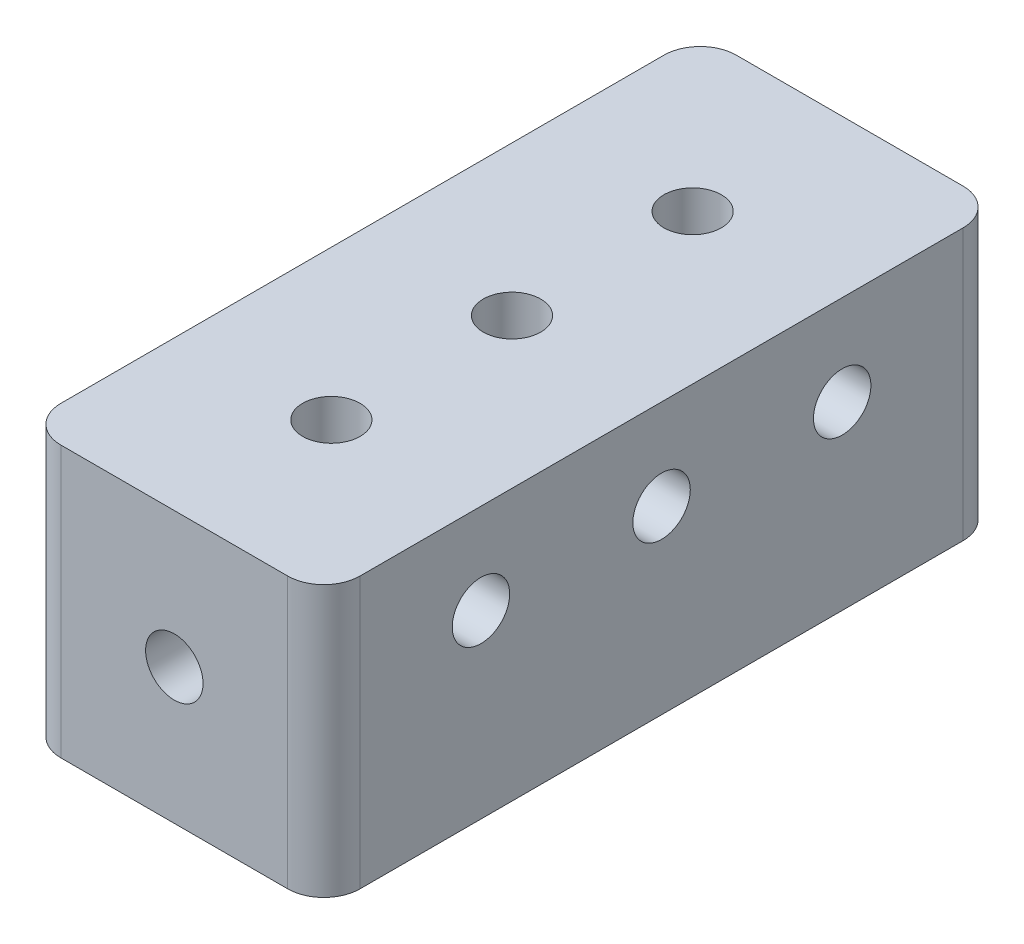
ISO-10303-21;
HEADER;
FILE_DESCRIPTION(('STEP AP214'),'2;1');
FILE_NAME('part.step','',(''),(''),'','','');
FILE_SCHEMA(('AUTOMOTIVE_DESIGN { 1 0 10303 214 1 1 1 1 }'));
ENDSEC;
DATA;
#1=APPLICATION_CONTEXT('core data for automotive mechanical design processes');
#2=APPLICATION_PROTOCOL_DEFINITION('international standard','automotive_design',2000,#1);
#3=PRODUCT_CONTEXT('',#1,'mechanical');
#4=PRODUCT('Part','Part','',(#3));
#5=PRODUCT_RELATED_PRODUCT_CATEGORY('part','',(#4));
#6=PRODUCT_DEFINITION_FORMATION('','',#4);
#7=PRODUCT_DEFINITION_CONTEXT('part definition',#1,'design');
#8=PRODUCT_DEFINITION('design','',#6,#7);
#9=PRODUCT_DEFINITION_SHAPE('','',#8);
#10=(LENGTH_UNIT() NAMED_UNIT(*) SI_UNIT(.MILLI.,.METRE.));
#11=(NAMED_UNIT(*) PLANE_ANGLE_UNIT() SI_UNIT($,.RADIAN.));
#12=(NAMED_UNIT(*) SI_UNIT($,.STERADIAN.) SOLID_ANGLE_UNIT());
#13=UNCERTAINTY_MEASURE_WITH_UNIT(LENGTH_MEASURE(1.E-05),#10,'distance_accuracy_value','');
#14=(GEOMETRIC_REPRESENTATION_CONTEXT(3) GLOBAL_UNCERTAINTY_ASSIGNED_CONTEXT((#13)) GLOBAL_UNIT_ASSIGNED_CONTEXT((#10,
#11,#12)) REPRESENTATION_CONTEXT('',''));
#15=CARTESIAN_POINT('',(0.,0.,0.));
#16=DIRECTION('',(0.,0.,1.));
#17=DIRECTION('',(1.,0.,0.));
#18=AXIS2_PLACEMENT_3D('',#15,#16,#17);
#19=CARTESIAN_POINT('',(10.5156,9.525,23.74265));
#20=DIRECTION('',(-1.,0.,0.));
#21=DIRECTION('',(0.,0.,1.));
#22=AXIS2_PLACEMENT_3D('',#19,#20,#21);
#23=PLANE('',#22);
#24=CARTESIAN_POINT('',(10.5156,3.175,12.7));
#25=DIRECTION('',(1.,0.,0.));
#26=DIRECTION('',(0.,0.,-1.));
#27=AXIS2_PLACEMENT_3D('',#24,#25,#26);
#28=CIRCLE('',#27,2.0193);
#29=CARTESIAN_POINT('',(10.5156,3.175,10.6807));
#30=VERTEX_POINT('',#29);
#31=EDGE_CURVE('E205',#30,#30,#28,.T.);
#32=ORIENTED_EDGE('',*,*,#31,.F.);
#33=EDGE_LOOP('',(#32));
#34=FACE_BOUND('',#33,.T.);
#35=CARTESIAN_POINT('',(10.5156,3.175,-12.7));
#36=DIRECTION('',(1.,0.,0.));
#37=DIRECTION('',(0.,0.,-1.));
#38=AXIS2_PLACEMENT_3D('',#35,#36,#37);
#39=CIRCLE('',#38,2.0193);
#40=CARTESIAN_POINT('',(10.5156,3.175,-14.7193));
#41=VERTEX_POINT('',#40);
#42=EDGE_CURVE('E199',#41,#41,#39,.T.);
#43=ORIENTED_EDGE('',*,*,#42,.F.);
#44=EDGE_LOOP('',(#43));
#45=FACE_BOUND('',#44,.T.);
#46=CARTESIAN_POINT('',(10.5156,3.175,0.));
#47=DIRECTION('',(1.,0.,0.));
#48=DIRECTION('',(0.,0.,-1.));
#49=AXIS2_PLACEMENT_3D('',#46,#47,#48);
#50=CIRCLE('',#49,2.0193);
#51=CARTESIAN_POINT('',(10.5156,3.175,-2.0193));
#52=VERTEX_POINT('',#51);
#53=EDGE_CURVE('E192',#52,#52,#50,.T.);
#54=ORIENTED_EDGE('',*,*,#53,.F.);
#55=EDGE_LOOP('',(#54));
#56=FACE_BOUND('',#55,.T.);
#57=DIRECTION('',(0.,0.,-1.));
#58=VECTOR('',#57,1.);
#59=CARTESIAN_POINT('',(10.5156,9.525,23.74265));
#60=LINE('',#59,#58);
#61=CARTESIAN_POINT('',(10.5156,9.525,21.20265));
#62=VERTEX_POINT('',#61);
#63=CARTESIAN_POINT('',(10.5156,9.525,-21.20265));
#64=VERTEX_POINT('',#63);
#65=EDGE_CURVE('E123',#62,#64,#60,.T.);
#66=ORIENTED_EDGE('',*,*,#65,.F.);
#67=DIRECTION('',(0.,-1.,0.));
#68=VECTOR('',#67,1.);
#69=CARTESIAN_POINT('',(10.5156,9.525,21.20265));
#70=LINE('',#69,#68);
#71=CARTESIAN_POINT('',(10.5156,-9.525,21.20265));
#72=VERTEX_POINT('',#71);
#73=EDGE_CURVE('E108',#62,#72,#70,.T.);
#74=ORIENTED_EDGE('',*,*,#73,.T.);
#75=DIRECTION('',(0.,0.,-1.));
#76=VECTOR('',#75,1.);
#77=CARTESIAN_POINT('',(10.5156,-9.525,23.74265));
#78=LINE('',#77,#76);
#79=CARTESIAN_POINT('',(10.5156,-9.525,-21.20265));
#80=VERTEX_POINT('',#79);
#81=EDGE_CURVE('E120',#72,#80,#78,.T.);
#82=ORIENTED_EDGE('',*,*,#81,.T.);
#83=DIRECTION('',(0.,-1.,0.));
#84=VECTOR('',#83,1.);
#85=CARTESIAN_POINT('',(10.5156,9.525,-21.20265));
#86=LINE('',#85,#84);
#87=EDGE_CURVE('E125',#80,#64,#86,.F.);
#88=ORIENTED_EDGE('',*,*,#87,.T.);
#89=EDGE_LOOP('',(#66,#74,#82,#88));
#90=FACE_BOUND('',#89,.T.);
#91=ADVANCED_FACE('F38',(#34,#45,#56,#90),#23,.F.);
#92=CARTESIAN_POINT('',(-10.5156,9.525,-23.74265));
#93=DIRECTION('',(0.,0.,1.));
#94=DIRECTION('',(1.,0.,0.));
#95=AXIS2_PLACEMENT_3D('',#92,#93,#94);
#96=PLANE('',#95);
#97=CARTESIAN_POINT('',(0.,0.,-23.74265));
#98=DIRECTION('',(0.,0.,-1.));
#99=DIRECTION('',(-1.,0.,0.));
#100=AXIS2_PLACEMENT_3D('',#97,#98,#99);
#101=CIRCLE('',#100,2.0193);
#102=CARTESIAN_POINT('',(-2.0193,0.,-23.74265));
#103=VERTEX_POINT('',#102);
#104=EDGE_CURVE('E186',#103,#103,#101,.T.);
#105=ORIENTED_EDGE('',*,*,#104,.F.);
#106=EDGE_LOOP('',(#105));
#107=FACE_BOUND('',#106,.T.);
#108=DIRECTION('',(-1.,0.,0.));
#109=VECTOR('',#108,1.);
#110=CARTESIAN_POINT('',(-10.5156,-9.525,-23.74265));
#111=LINE('',#110,#109);
#112=CARTESIAN_POINT('',(7.9756,-9.525,-23.74265));
#113=VERTEX_POINT('',#112);
#114=CARTESIAN_POINT('',(-7.9756,-9.525,-23.74265));
#115=VERTEX_POINT('',#114);
#116=EDGE_CURVE('E129',#113,#115,#111,.T.);
#117=ORIENTED_EDGE('',*,*,#116,.T.);
#118=DIRECTION('',(0.,-1.,0.));
#119=VECTOR('',#118,1.);
#120=CARTESIAN_POINT('',(-7.9756,9.525,-23.74265));
#121=LINE('',#120,#119);
#122=CARTESIAN_POINT('',(-7.9756,9.525,-23.74265));
#123=VERTEX_POINT('',#122);
#124=EDGE_CURVE('E11',#115,#123,#121,.F.);
#125=ORIENTED_EDGE('',*,*,#124,.T.);
#126=DIRECTION('',(-1.,0.,0.));
#127=VECTOR('',#126,1.);
#128=CARTESIAN_POINT('',(-10.5156,9.525,-23.74265));
#129=LINE('',#128,#127);
#130=CARTESIAN_POINT('',(7.9756,9.525,-23.74265));
#131=VERTEX_POINT('',#130);
#132=EDGE_CURVE('E169',#131,#123,#129,.T.);
#133=ORIENTED_EDGE('',*,*,#132,.F.);
#134=DIRECTION('',(0.,-1.,0.));
#135=VECTOR('',#134,1.);
#136=CARTESIAN_POINT('',(7.9756,9.525,-23.74265));
#137=LINE('',#136,#135);
#138=EDGE_CURVE('E46',#131,#113,#137,.T.);
#139=ORIENTED_EDGE('',*,*,#138,.T.);
#140=EDGE_LOOP('',(#117,#125,#133,#139));
#141=FACE_BOUND('',#140,.T.);
#142=ADVANCED_FACE('F167',(#107,#141),#96,.F.);
#143=CARTESIAN_POINT('',(-10.5156,9.525,23.74265));
#144=DIRECTION('',(1.,0.,0.));
#145=DIRECTION('',(0.,0.,-1.));
#146=AXIS2_PLACEMENT_3D('',#143,#144,#145);
#147=PLANE('',#146);
#148=CARTESIAN_POINT('',(-10.5156,3.175,-12.7));
#149=DIRECTION('',(-1.,0.,0.));
#150=DIRECTION('',(0.,0.,1.));
#151=AXIS2_PLACEMENT_3D('',#148,#149,#150);
#152=CIRCLE('',#151,2.0193);
#153=CARTESIAN_POINT('',(-10.5156,3.175,-10.6807));
#154=VERTEX_POINT('',#153);
#155=EDGE_CURVE('E223',#154,#154,#152,.T.);
#156=ORIENTED_EDGE('',*,*,#155,.F.);
#157=EDGE_LOOP('',(#156));
#158=FACE_BOUND('',#157,.T.);
#159=CARTESIAN_POINT('',(-10.5156,3.175,0.));
#160=DIRECTION('',(-1.,0.,0.));
#161=DIRECTION('',(0.,0.,1.));
#162=AXIS2_PLACEMENT_3D('',#159,#160,#161);
#163=CIRCLE('',#162,2.0193);
#164=CARTESIAN_POINT('',(-10.5156,3.175,2.0193));
#165=VERTEX_POINT('',#164);
#166=EDGE_CURVE('E217',#165,#165,#163,.T.);
#167=ORIENTED_EDGE('',*,*,#166,.F.);
#168=EDGE_LOOP('',(#167));
#169=FACE_BOUND('',#168,.T.);
#170=CARTESIAN_POINT('',(-10.5156,3.175,12.7));
#171=DIRECTION('',(-1.,0.,0.));
#172=DIRECTION('',(0.,0.,1.));
#173=AXIS2_PLACEMENT_3D('',#170,#171,#172);
#174=CIRCLE('',#173,2.0193);
#175=CARTESIAN_POINT('',(-10.5156,3.175,14.7193));
#176=VERTEX_POINT('',#175);
#177=EDGE_CURVE('E210',#176,#176,#174,.T.);
#178=ORIENTED_EDGE('',*,*,#177,.F.);
#179=EDGE_LOOP('',(#178));
#180=FACE_BOUND('',#179,.T.);
#181=DIRECTION('',(0.,0.,1.));
#182=VECTOR('',#181,1.);
#183=CARTESIAN_POINT('',(-10.5156,-9.525,23.74265));
#184=LINE('',#183,#182);
#185=CARTESIAN_POINT('',(-10.5156,-9.525,-21.20265));
#186=VERTEX_POINT('',#185);
#187=CARTESIAN_POINT('',(-10.5156,-9.525,21.20265));
#188=VERTEX_POINT('',#187);
#189=EDGE_CURVE('E133',#186,#188,#184,.T.);
#190=ORIENTED_EDGE('',*,*,#189,.T.);
#191=DIRECTION('',(0.,-1.,0.));
#192=VECTOR('',#191,1.);
#193=CARTESIAN_POINT('',(-10.5156,9.525,21.20265));
#194=LINE('',#193,#192);
#195=CARTESIAN_POINT('',(-10.5156,9.525,21.20265));
#196=VERTEX_POINT('',#195);
#197=EDGE_CURVE('E53',#188,#196,#194,.F.);
#198=ORIENTED_EDGE('',*,*,#197,.T.);
#199=DIRECTION('',(0.,0.,1.));
#200=VECTOR('',#199,1.);
#201=CARTESIAN_POINT('',(-10.5156,9.525,23.74265));
#202=LINE('',#201,#200);
#203=CARTESIAN_POINT('',(-10.5156,9.525,-21.20265));
#204=VERTEX_POINT('',#203);
#205=EDGE_CURVE('E177',#204,#196,#202,.T.);
#206=ORIENTED_EDGE('',*,*,#205,.F.);
#207=DIRECTION('',(0.,-1.,0.));
#208=VECTOR('',#207,1.);
#209=CARTESIAN_POINT('',(-10.5156,9.525,-21.20265));
#210=LINE('',#209,#208);
#211=EDGE_CURVE('E160',#204,#186,#210,.T.);
#212=ORIENTED_EDGE('',*,*,#211,.T.);
#213=EDGE_LOOP('',(#190,#198,#206,#212));
#214=FACE_BOUND('',#213,.T.);
#215=ADVANCED_FACE('F176',(#158,#169,#180,#214),#147,.F.);
#216=CARTESIAN_POINT('',(-10.5156,9.525,23.74265));
#217=DIRECTION('',(0.,0.,-1.));
#218=DIRECTION('',(-1.,0.,0.));
#219=AXIS2_PLACEMENT_3D('',#216,#217,#218);
#220=PLANE('',#219);
#221=CARTESIAN_POINT('',(0.,0.,23.74265));
#222=DIRECTION('',(0.,0.,1.));
#223=DIRECTION('',(1.,0.,0.));
#224=AXIS2_PLACEMENT_3D('',#221,#222,#223);
#225=CIRCLE('',#224,2.0193);
#226=CARTESIAN_POINT('',(2.0193,0.,23.74265));
#227=VERTEX_POINT('',#226);
#228=EDGE_CURVE('E136',#227,#227,#225,.T.);
#229=ORIENTED_EDGE('',*,*,#228,.F.);
#230=EDGE_LOOP('',(#229));
#231=FACE_BOUND('',#230,.T.);
#232=DIRECTION('',(1.,0.,0.));
#233=VECTOR('',#232,1.);
#234=CARTESIAN_POINT('',(-10.5156,-9.525,23.74265));
#235=LINE('',#234,#233);
#236=CARTESIAN_POINT('',(-7.9756,-9.525,23.74265));
#237=VERTEX_POINT('',#236);
#238=CARTESIAN_POINT('',(7.9756,-9.525,23.74265));
#239=VERTEX_POINT('',#238);
#240=EDGE_CURVE('E143',#237,#239,#235,.T.);
#241=ORIENTED_EDGE('',*,*,#240,.T.);
#242=DIRECTION('',(0.,-1.,0.));
#243=VECTOR('',#242,1.);
#244=CARTESIAN_POINT('',(7.9756,9.525,23.74265));
#245=LINE('',#244,#243);
#246=CARTESIAN_POINT('',(7.9756,9.525,23.74265));
#247=VERTEX_POINT('',#246);
#248=EDGE_CURVE('E109',#239,#247,#245,.F.);
#249=ORIENTED_EDGE('',*,*,#248,.T.);
#250=DIRECTION('',(1.,0.,0.));
#251=VECTOR('',#250,1.);
#252=CARTESIAN_POINT('',(-10.5156,9.525,23.74265));
#253=LINE('',#252,#251);
#254=CARTESIAN_POINT('',(-7.9756,9.525,23.74265));
#255=VERTEX_POINT('',#254);
#256=EDGE_CURVE('E139',#255,#247,#253,.T.);
#257=ORIENTED_EDGE('',*,*,#256,.F.);
#258=DIRECTION('',(0.,-1.,0.));
#259=VECTOR('',#258,1.);
#260=CARTESIAN_POINT('',(-7.9756,9.525,23.74265));
#261=LINE('',#260,#259);
#262=EDGE_CURVE('E114',#255,#237,#261,.T.);
#263=ORIENTED_EDGE('',*,*,#262,.T.);
#264=EDGE_LOOP('',(#241,#249,#257,#263));
#265=FACE_BOUND('',#264,.T.);
#266=ADVANCED_FACE('F258',(#231,#265),#220,.F.);
#267=CARTESIAN_POINT('',(0.,9.525,0.));
#268=DIRECTION('',(0.,-1.,0.));
#269=DIRECTION('',(0.,0.,-1.));
#270=AXIS2_PLACEMENT_3D('',#267,#268,#269);
#271=PLANE('',#270);
#272=CARTESIAN_POINT('',(0.,9.525,-12.7));
#273=DIRECTION('',(0.,1.,0.));
#274=DIRECTION('',(0.,0.,1.));
#275=AXIS2_PLACEMENT_3D('',#272,#273,#274);
#276=CIRCLE('',#275,2.0193);
#277=CARTESIAN_POINT('',(0.,9.525,-10.6807));
#278=VERTEX_POINT('',#277);
#279=EDGE_CURVE('E240',#278,#278,#276,.T.);
#280=ORIENTED_EDGE('',*,*,#279,.F.);
#281=EDGE_LOOP('',(#280));
#282=FACE_BOUND('',#281,.T.);
#283=CARTESIAN_POINT('',(0.,9.525,0.));
#284=DIRECTION('',(0.,1.,0.));
#285=DIRECTION('',(0.,0.,1.));
#286=AXIS2_PLACEMENT_3D('',#283,#284,#285);
#287=CIRCLE('',#286,2.0193);
#288=CARTESIAN_POINT('',(0.,9.525,2.0193));
#289=VERTEX_POINT('',#288);
#290=EDGE_CURVE('E234',#289,#289,#287,.T.);
#291=ORIENTED_EDGE('',*,*,#290,.F.);
#292=EDGE_LOOP('',(#291));
#293=FACE_BOUND('',#292,.T.);
#294=CARTESIAN_POINT('',(0.,9.525,12.7));
#295=DIRECTION('',(0.,1.,0.));
#296=DIRECTION('',(0.,0.,1.));
#297=AXIS2_PLACEMENT_3D('',#294,#295,#296);
#298=CIRCLE('',#297,2.0193);
#299=CARTESIAN_POINT('',(0.,9.525,14.7193));
#300=VERTEX_POINT('',#299);
#301=EDGE_CURVE('E228',#300,#300,#298,.T.);
#302=ORIENTED_EDGE('',*,*,#301,.F.);
#303=EDGE_LOOP('',(#302));
#304=FACE_BOUND('',#303,.T.);
#305=ORIENTED_EDGE('',*,*,#256,.T.);
#306=CARTESIAN_POINT('',(7.9756,9.525,21.20265));
#307=DIRECTION('',(0.,-1.,0.));
#308=DIRECTION('',(0.,0.,-1.));
#309=AXIS2_PLACEMENT_3D('',#306,#307,#308);
#310=CIRCLE('',#309,2.54);
#311=EDGE_CURVE('E158',#247,#62,#310,.F.);
#312=ORIENTED_EDGE('',*,*,#311,.T.);
#313=ORIENTED_EDGE('',*,*,#65,.T.);
#314=CARTESIAN_POINT('',(7.9756,9.525,-21.20265));
#315=DIRECTION('',(0.,-1.,0.));
#316=DIRECTION('',(0.,0.,-1.));
#317=AXIS2_PLACEMENT_3D('',#314,#315,#316);
#318=CIRCLE('',#317,2.54);
#319=EDGE_CURVE('E153',#64,#131,#318,.F.);
#320=ORIENTED_EDGE('',*,*,#319,.T.);
#321=ORIENTED_EDGE('',*,*,#132,.T.);
#322=CARTESIAN_POINT('',(-7.9756,9.525,-21.20265));
#323=DIRECTION('',(0.,-1.,0.));
#324=DIRECTION('',(0.,0.,-1.));
#325=AXIS2_PLACEMENT_3D('',#322,#323,#324);
#326=CIRCLE('',#325,2.54);
#327=EDGE_CURVE('E60',#123,#204,#326,.F.);
#328=ORIENTED_EDGE('',*,*,#327,.T.);
#329=ORIENTED_EDGE('',*,*,#205,.T.);
#330=CARTESIAN_POINT('',(-7.9756,9.525,21.20265));
#331=DIRECTION('',(0.,-1.,0.));
#332=DIRECTION('',(0.,0.,-1.));
#333=AXIS2_PLACEMENT_3D('',#330,#331,#332);
#334=CIRCLE('',#333,2.54);
#335=EDGE_CURVE('E156',#196,#255,#334,.F.);
#336=ORIENTED_EDGE('',*,*,#335,.T.);
#337=EDGE_LOOP('',(#305,#312,#313,#320,#321,#328,#329,#336));
#338=FACE_BOUND('',#337,.T.);
#339=ADVANCED_FACE('F255',(#282,#293,#304,#338),#271,.F.);
#340=CARTESIAN_POINT('',(0.,-9.525,0.));
#341=DIRECTION('',(0.,-1.,0.));
#342=DIRECTION('',(0.,0.,-1.));
#343=AXIS2_PLACEMENT_3D('',#340,#341,#342);
#344=PLANE('',#343);
#345=ORIENTED_EDGE('',*,*,#81,.F.);
#346=CARTESIAN_POINT('',(7.9756,-9.525,21.20265));
#347=DIRECTION('',(0.,-1.,0.));
#348=DIRECTION('',(0.,0.,-1.));
#349=AXIS2_PLACEMENT_3D('',#346,#347,#348);
#350=CIRCLE('',#349,2.54);
#351=EDGE_CURVE('E104',#72,#239,#350,.T.);
#352=ORIENTED_EDGE('',*,*,#351,.T.);
#353=ORIENTED_EDGE('',*,*,#240,.F.);
#354=CARTESIAN_POINT('',(-7.9756,-9.525,21.20265));
#355=DIRECTION('',(0.,-1.,0.));
#356=DIRECTION('',(0.,0.,-1.));
#357=AXIS2_PLACEMENT_3D('',#354,#355,#356);
#358=CIRCLE('',#357,2.54);
#359=EDGE_CURVE('E115',#237,#188,#358,.T.);
#360=ORIENTED_EDGE('',*,*,#359,.T.);
#361=ORIENTED_EDGE('',*,*,#189,.F.);
#362=CARTESIAN_POINT('',(-7.9756,-9.525,-21.20265));
#363=DIRECTION('',(0.,-1.,0.));
#364=DIRECTION('',(0.,0.,-1.));
#365=AXIS2_PLACEMENT_3D('',#362,#363,#364);
#366=CIRCLE('',#365,2.54);
#367=EDGE_CURVE('E147',#186,#115,#366,.T.);
#368=ORIENTED_EDGE('',*,*,#367,.T.);
#369=ORIENTED_EDGE('',*,*,#116,.F.);
#370=CARTESIAN_POINT('',(7.9756,-9.525,-21.20265));
#371=DIRECTION('',(0.,-1.,0.));
#372=DIRECTION('',(0.,0.,-1.));
#373=AXIS2_PLACEMENT_3D('',#370,#371,#372);
#374=CIRCLE('',#373,2.54);
#375=EDGE_CURVE('E124',#113,#80,#374,.T.);
#376=ORIENTED_EDGE('',*,*,#375,.T.);
#377=EDGE_LOOP('',(#345,#352,#353,#360,#361,#368,#369,#376));
#378=FACE_BOUND('',#377,.T.);
#379=ADVANCED_FACE('F127',(#378),#344,.T.);
#380=CARTESIAN_POINT('',(0.,0.,14.21765));
#381=DIRECTION('',(0.,0.,1.));
#382=DIRECTION('',(1.,0.,0.));
#383=AXIS2_PLACEMENT_3D('',#380,#381,#382);
#384=CYLINDRICAL_SURFACE('',#383,2.0193);
#385=CARTESIAN_POINT('',(0.,0.,14.21765));
#386=DIRECTION('',(0.,0.,1.));
#387=DIRECTION('',(1.,0.,0.));
#388=AXIS2_PLACEMENT_3D('',#385,#386,#387);
#389=CIRCLE('',#388,2.0193);
#390=CARTESIAN_POINT('',(2.0193,0.,14.21765));
#391=VERTEX_POINT('',#390);
#392=EDGE_CURVE('E130',#391,#391,#389,.T.);
#393=ORIENTED_EDGE('',*,*,#392,.F.);
#394=EDGE_LOOP('',(#393));
#395=FACE_BOUND('',#394,.T.);
#396=ORIENTED_EDGE('',*,*,#228,.T.);
#397=EDGE_LOOP('',(#396));
#398=FACE_BOUND('',#397,.T.);
#399=ADVANCED_FACE('F293',(#395,#398),#384,.F.);
#400=CARTESIAN_POINT('',(0.,0.,14.21765));
#401=DIRECTION('',(0.,0.,1.));
#402=DIRECTION('',(1.,0.,0.));
#403=AXIS2_PLACEMENT_3D('',#400,#401,#402);
#404=PLANE('',#403);
#405=ORIENTED_EDGE('',*,*,#392,.T.);
#406=EDGE_LOOP('',(#405));
#407=FACE_BOUND('',#406,.T.);
#408=ADVANCED_FACE('F297',(#407),#404,.T.);
#409=CARTESIAN_POINT('',(0.,0.,-14.21765));
#410=DIRECTION('',(0.,0.,-1.));
#411=DIRECTION('',(-1.,0.,0.));
#412=AXIS2_PLACEMENT_3D('',#409,#410,#411);
#413=CYLINDRICAL_SURFACE('',#412,2.0193);
#414=CARTESIAN_POINT('',(0.,0.,-14.21765));
#415=DIRECTION('',(0.,0.,-1.));
#416=DIRECTION('',(-1.,0.,0.));
#417=AXIS2_PLACEMENT_3D('',#414,#415,#416);
#418=CIRCLE('',#417,2.0193);
#419=CARTESIAN_POINT('',(-2.0193,0.,-14.21765));
#420=VERTEX_POINT('',#419);
#421=EDGE_CURVE('E184',#420,#420,#418,.T.);
#422=ORIENTED_EDGE('',*,*,#421,.F.);
#423=EDGE_LOOP('',(#422));
#424=FACE_BOUND('',#423,.T.);
#425=ORIENTED_EDGE('',*,*,#104,.T.);
#426=EDGE_LOOP('',(#425));
#427=FACE_BOUND('',#426,.T.);
#428=ADVANCED_FACE('F301',(#424,#427),#413,.F.);
#429=CARTESIAN_POINT('',(0.,0.,-14.21765));
#430=DIRECTION('',(0.,0.,-1.));
#431=DIRECTION('',(-1.,0.,0.));
#432=AXIS2_PLACEMENT_3D('',#429,#430,#431);
#433=PLANE('',#432);
#434=ORIENTED_EDGE('',*,*,#421,.T.);
#435=EDGE_LOOP('',(#434));
#436=FACE_BOUND('',#435,.T.);
#437=ADVANCED_FACE('F305',(#436),#433,.T.);
#438=CARTESIAN_POINT('',(4.1656,3.175,0.));
#439=DIRECTION('',(1.,0.,0.));
#440=DIRECTION('',(0.,0.,-1.));
#441=AXIS2_PLACEMENT_3D('',#438,#439,#440);
#442=CYLINDRICAL_SURFACE('',#441,2.0193);
#443=CARTESIAN_POINT('',(4.1656,3.175,0.));
#444=DIRECTION('',(1.,0.,0.));
#445=DIRECTION('',(0.,0.,-1.));
#446=AXIS2_PLACEMENT_3D('',#443,#444,#445);
#447=CIRCLE('',#446,2.0193);
#448=CARTESIAN_POINT('',(4.1656,3.175,-2.0193));
#449=VERTEX_POINT('',#448);
#450=EDGE_CURVE('E195',#449,#449,#447,.T.);
#451=ORIENTED_EDGE('',*,*,#450,.F.);
#452=EDGE_LOOP('',(#451));
#453=FACE_BOUND('',#452,.T.);
#454=ORIENTED_EDGE('',*,*,#53,.T.);
#455=EDGE_LOOP('',(#454));
#456=FACE_BOUND('',#455,.T.);
#457=ADVANCED_FACE('F309',(#453,#456),#442,.F.);
#458=CARTESIAN_POINT('',(4.1656,3.175,0.));
#459=DIRECTION('',(1.,0.,0.));
#460=DIRECTION('',(0.,0.,-1.));
#461=AXIS2_PLACEMENT_3D('',#458,#459,#460);
#462=PLANE('',#461);
#463=ORIENTED_EDGE('',*,*,#450,.T.);
#464=EDGE_LOOP('',(#463));
#465=FACE_BOUND('',#464,.T.);
#466=ADVANCED_FACE('F313',(#465),#462,.T.);
#467=CARTESIAN_POINT('',(4.1656,3.175,-12.7));
#468=DIRECTION('',(1.,0.,0.));
#469=DIRECTION('',(0.,0.,-1.));
#470=AXIS2_PLACEMENT_3D('',#467,#468,#469);
#471=CYLINDRICAL_SURFACE('',#470,2.0193);
#472=CARTESIAN_POINT('',(4.1656,3.175,-12.7));
#473=DIRECTION('',(1.,0.,0.));
#474=DIRECTION('',(0.,0.,-1.));
#475=AXIS2_PLACEMENT_3D('',#472,#473,#474);
#476=CIRCLE('',#475,2.0193);
#477=CARTESIAN_POINT('',(4.1656,3.175,-14.7193));
#478=VERTEX_POINT('',#477);
#479=EDGE_CURVE('E202',#478,#478,#476,.T.);
#480=ORIENTED_EDGE('',*,*,#479,.F.);
#481=EDGE_LOOP('',(#480));
#482=FACE_BOUND('',#481,.T.);
#483=ORIENTED_EDGE('',*,*,#42,.T.);
#484=EDGE_LOOP('',(#483));
#485=FACE_BOUND('',#484,.T.);
#486=ADVANCED_FACE('F317',(#482,#485),#471,.F.);
#487=CARTESIAN_POINT('',(4.1656,3.175,-12.7));
#488=DIRECTION('',(1.,0.,0.));
#489=DIRECTION('',(0.,0.,-1.));
#490=AXIS2_PLACEMENT_3D('',#487,#488,#489);
#491=PLANE('',#490);
#492=ORIENTED_EDGE('',*,*,#479,.T.);
#493=EDGE_LOOP('',(#492));
#494=FACE_BOUND('',#493,.T.);
#495=ADVANCED_FACE('F321',(#494),#491,.T.);
#496=CARTESIAN_POINT('',(4.1656,3.175,12.7));
#497=DIRECTION('',(1.,0.,0.));
#498=DIRECTION('',(0.,0.,-1.));
#499=AXIS2_PLACEMENT_3D('',#496,#497,#498);
#500=CYLINDRICAL_SURFACE('',#499,2.0193);
#501=CARTESIAN_POINT('',(4.1656,3.175,12.7));
#502=DIRECTION('',(1.,0.,0.));
#503=DIRECTION('',(0.,0.,-1.));
#504=AXIS2_PLACEMENT_3D('',#501,#502,#503);
#505=CIRCLE('',#504,2.0193);
#506=CARTESIAN_POINT('',(4.1656,3.175,10.6807));
#507=VERTEX_POINT('',#506);
#508=EDGE_CURVE('E189',#507,#507,#505,.T.);
#509=ORIENTED_EDGE('',*,*,#508,.F.);
#510=EDGE_LOOP('',(#509));
#511=FACE_BOUND('',#510,.T.);
#512=ORIENTED_EDGE('',*,*,#31,.T.);
#513=EDGE_LOOP('',(#512));
#514=FACE_BOUND('',#513,.T.);
#515=ADVANCED_FACE('F325',(#511,#514),#500,.F.);
#516=CARTESIAN_POINT('',(4.1656,3.175,12.7));
#517=DIRECTION('',(1.,0.,0.));
#518=DIRECTION('',(0.,0.,-1.));
#519=AXIS2_PLACEMENT_3D('',#516,#517,#518);
#520=PLANE('',#519);
#521=ORIENTED_EDGE('',*,*,#508,.T.);
#522=EDGE_LOOP('',(#521));
#523=FACE_BOUND('',#522,.T.);
#524=ADVANCED_FACE('F329',(#523),#520,.T.);
#525=CARTESIAN_POINT('',(-4.1656,3.175,12.7));
#526=DIRECTION('',(-1.,0.,0.));
#527=DIRECTION('',(0.,0.,1.));
#528=AXIS2_PLACEMENT_3D('',#525,#526,#527);
#529=CYLINDRICAL_SURFACE('',#528,2.0193);
#530=CARTESIAN_POINT('',(-4.1656,3.175,12.7));
#531=DIRECTION('',(-1.,0.,0.));
#532=DIRECTION('',(0.,0.,1.));
#533=AXIS2_PLACEMENT_3D('',#530,#531,#532);
#534=CIRCLE('',#533,2.0193);
#535=CARTESIAN_POINT('',(-4.1656,3.175,14.7193));
#536=VERTEX_POINT('',#535);
#537=EDGE_CURVE('E213',#536,#536,#534,.T.);
#538=ORIENTED_EDGE('',*,*,#537,.F.);
#539=EDGE_LOOP('',(#538));
#540=FACE_BOUND('',#539,.T.);
#541=ORIENTED_EDGE('',*,*,#177,.T.);
#542=EDGE_LOOP('',(#541));
#543=FACE_BOUND('',#542,.T.);
#544=ADVANCED_FACE('F333',(#540,#543),#529,.F.);
#545=CARTESIAN_POINT('',(-4.1656,3.175,12.7));
#546=DIRECTION('',(-1.,0.,0.));
#547=DIRECTION('',(0.,0.,1.));
#548=AXIS2_PLACEMENT_3D('',#545,#546,#547);
#549=PLANE('',#548);
#550=ORIENTED_EDGE('',*,*,#537,.T.);
#551=EDGE_LOOP('',(#550));
#552=FACE_BOUND('',#551,.T.);
#553=ADVANCED_FACE('F337',(#552),#549,.T.);
#554=CARTESIAN_POINT('',(-4.1656,3.175,0.));
#555=DIRECTION('',(-1.,0.,0.));
#556=DIRECTION('',(0.,0.,1.));
#557=AXIS2_PLACEMENT_3D('',#554,#555,#556);
#558=CYLINDRICAL_SURFACE('',#557,2.0193);
#559=CARTESIAN_POINT('',(-4.1656,3.175,0.));
#560=DIRECTION('',(-1.,0.,0.));
#561=DIRECTION('',(0.,0.,1.));
#562=AXIS2_PLACEMENT_3D('',#559,#560,#561);
#563=CIRCLE('',#562,2.0193);
#564=CARTESIAN_POINT('',(-4.1656,3.175,2.0193));
#565=VERTEX_POINT('',#564);
#566=EDGE_CURVE('E220',#565,#565,#563,.T.);
#567=ORIENTED_EDGE('',*,*,#566,.F.);
#568=EDGE_LOOP('',(#567));
#569=FACE_BOUND('',#568,.T.);
#570=ORIENTED_EDGE('',*,*,#166,.T.);
#571=EDGE_LOOP('',(#570));
#572=FACE_BOUND('',#571,.T.);
#573=ADVANCED_FACE('F341',(#569,#572),#558,.F.);
#574=CARTESIAN_POINT('',(-4.1656,3.175,0.));
#575=DIRECTION('',(-1.,0.,0.));
#576=DIRECTION('',(0.,0.,1.));
#577=AXIS2_PLACEMENT_3D('',#574,#575,#576);
#578=PLANE('',#577);
#579=ORIENTED_EDGE('',*,*,#566,.T.);
#580=EDGE_LOOP('',(#579));
#581=FACE_BOUND('',#580,.T.);
#582=ADVANCED_FACE('F345',(#581),#578,.T.);
#583=CARTESIAN_POINT('',(-4.1656,3.175,-12.7));
#584=DIRECTION('',(-1.,0.,0.));
#585=DIRECTION('',(0.,0.,1.));
#586=AXIS2_PLACEMENT_3D('',#583,#584,#585);
#587=CYLINDRICAL_SURFACE('',#586,2.0193);
#588=CARTESIAN_POINT('',(-4.1656,3.175,-12.7));
#589=DIRECTION('',(-1.,0.,0.));
#590=DIRECTION('',(0.,0.,1.));
#591=AXIS2_PLACEMENT_3D('',#588,#589,#590);
#592=CIRCLE('',#591,2.0193);
#593=CARTESIAN_POINT('',(-4.1656,3.175,-10.6807));
#594=VERTEX_POINT('',#593);
#595=EDGE_CURVE('E196',#594,#594,#592,.T.);
#596=ORIENTED_EDGE('',*,*,#595,.F.);
#597=EDGE_LOOP('',(#596));
#598=FACE_BOUND('',#597,.T.);
#599=ORIENTED_EDGE('',*,*,#155,.T.);
#600=EDGE_LOOP('',(#599));
#601=FACE_BOUND('',#600,.T.);
#602=ADVANCED_FACE('F349',(#598,#601),#587,.F.);
#603=CARTESIAN_POINT('',(-4.1656,3.175,-12.7));
#604=DIRECTION('',(-1.,0.,0.));
#605=DIRECTION('',(0.,0.,1.));
#606=AXIS2_PLACEMENT_3D('',#603,#604,#605);
#607=PLANE('',#606);
#608=ORIENTED_EDGE('',*,*,#595,.T.);
#609=EDGE_LOOP('',(#608));
#610=FACE_BOUND('',#609,.T.);
#611=ADVANCED_FACE('F353',(#610),#607,.T.);
#612=CARTESIAN_POINT('',(0.,3.175,12.7));
#613=DIRECTION('',(0.,1.,0.));
#614=DIRECTION('',(0.,0.,1.));
#615=AXIS2_PLACEMENT_3D('',#612,#613,#614);
#616=CYLINDRICAL_SURFACE('',#615,2.0193);
#617=CARTESIAN_POINT('',(0.,3.175,12.7));
#618=DIRECTION('',(0.,1.,0.));
#619=DIRECTION('',(0.,0.,1.));
#620=AXIS2_PLACEMENT_3D('',#617,#618,#619);
#621=CIRCLE('',#620,2.0193);
#622=CARTESIAN_POINT('',(0.,3.175,14.7193));
#623=VERTEX_POINT('',#622);
#624=EDGE_CURVE('E231',#623,#623,#621,.T.);
#625=ORIENTED_EDGE('',*,*,#624,.F.);
#626=EDGE_LOOP('',(#625));
#627=FACE_BOUND('',#626,.T.);
#628=ORIENTED_EDGE('',*,*,#301,.T.);
#629=EDGE_LOOP('',(#628));
#630=FACE_BOUND('',#629,.T.);
#631=ADVANCED_FACE('F357',(#627,#630),#616,.F.);
#632=CARTESIAN_POINT('',(0.,3.175,12.7));
#633=DIRECTION('',(0.,1.,0.));
#634=DIRECTION('',(0.,0.,1.));
#635=AXIS2_PLACEMENT_3D('',#632,#633,#634);
#636=PLANE('',#635);
#637=ORIENTED_EDGE('',*,*,#624,.T.);
#638=EDGE_LOOP('',(#637));
#639=FACE_BOUND('',#638,.T.);
#640=ADVANCED_FACE('F361',(#639),#636,.T.);
#641=CARTESIAN_POINT('',(0.,3.175,0.));
#642=DIRECTION('',(0.,1.,0.));
#643=DIRECTION('',(0.,0.,1.));
#644=AXIS2_PLACEMENT_3D('',#641,#642,#643);
#645=CYLINDRICAL_SURFACE('',#644,2.0193);
#646=CARTESIAN_POINT('',(0.,3.175,0.));
#647=DIRECTION('',(0.,1.,0.));
#648=DIRECTION('',(0.,0.,1.));
#649=AXIS2_PLACEMENT_3D('',#646,#647,#648);
#650=CIRCLE('',#649,2.0193);
#651=CARTESIAN_POINT('',(0.,3.175,2.0193));
#652=VERTEX_POINT('',#651);
#653=EDGE_CURVE('E237',#652,#652,#650,.T.);
#654=ORIENTED_EDGE('',*,*,#653,.F.);
#655=EDGE_LOOP('',(#654));
#656=FACE_BOUND('',#655,.T.);
#657=ORIENTED_EDGE('',*,*,#290,.T.);
#658=EDGE_LOOP('',(#657));
#659=FACE_BOUND('',#658,.T.);
#660=ADVANCED_FACE('F365',(#656,#659),#645,.F.);
#661=CARTESIAN_POINT('',(0.,3.175,0.));
#662=DIRECTION('',(0.,1.,0.));
#663=DIRECTION('',(0.,0.,1.));
#664=AXIS2_PLACEMENT_3D('',#661,#662,#663);
#665=PLANE('',#664);
#666=ORIENTED_EDGE('',*,*,#653,.T.);
#667=EDGE_LOOP('',(#666));
#668=FACE_BOUND('',#667,.T.);
#669=ADVANCED_FACE('F251',(#668),#665,.T.);
#670=CARTESIAN_POINT('',(0.,3.175,-12.7));
#671=DIRECTION('',(0.,1.,0.));
#672=DIRECTION('',(0.,0.,1.));
#673=AXIS2_PLACEMENT_3D('',#670,#671,#672);
#674=CYLINDRICAL_SURFACE('',#673,2.0193);
#675=CARTESIAN_POINT('',(0.,3.175,-12.7));
#676=DIRECTION('',(0.,1.,0.));
#677=DIRECTION('',(0.,0.,1.));
#678=AXIS2_PLACEMENT_3D('',#675,#676,#677);
#679=CIRCLE('',#678,2.0193);
#680=CARTESIAN_POINT('',(0.,3.175,-10.6807));
#681=VERTEX_POINT('',#680);
#682=EDGE_CURVE('E214',#681,#681,#679,.T.);
#683=ORIENTED_EDGE('',*,*,#682,.F.);
#684=EDGE_LOOP('',(#683));
#685=FACE_BOUND('',#684,.T.);
#686=ORIENTED_EDGE('',*,*,#279,.T.);
#687=EDGE_LOOP('',(#686));
#688=FACE_BOUND('',#687,.T.);
#689=ADVANCED_FACE('F248',(#685,#688),#674,.F.);
#690=CARTESIAN_POINT('',(0.,3.175,-12.7));
#691=DIRECTION('',(0.,1.,0.));
#692=DIRECTION('',(0.,0.,1.));
#693=AXIS2_PLACEMENT_3D('',#690,#691,#692);
#694=PLANE('',#693);
#695=ORIENTED_EDGE('',*,*,#682,.T.);
#696=EDGE_LOOP('',(#695));
#697=FACE_BOUND('',#696,.T.);
#698=ADVANCED_FACE('F246',(#697),#694,.T.);
#699=CARTESIAN_POINT('',(7.9756,9.525,21.20265));
#700=DIRECTION('',(0.,-1.,0.));
#701=DIRECTION('',(0.,0.,-1.));
#702=AXIS2_PLACEMENT_3D('',#699,#700,#701);
#703=CYLINDRICAL_SURFACE('',#702,2.54);
#704=ORIENTED_EDGE('',*,*,#311,.F.);
#705=ORIENTED_EDGE('',*,*,#248,.F.);
#706=ORIENTED_EDGE('',*,*,#351,.F.);
#707=ORIENTED_EDGE('',*,*,#73,.F.);
#708=EDGE_LOOP('',(#704,#705,#706,#707));
#709=FACE_BOUND('',#708,.T.);
#710=ADVANCED_FACE('F107',(#709),#703,.T.);
#711=CARTESIAN_POINT('',(-7.9756,9.525,21.20265));
#712=DIRECTION('',(0.,-1.,0.));
#713=DIRECTION('',(0.,0.,-1.));
#714=AXIS2_PLACEMENT_3D('',#711,#712,#713);
#715=CYLINDRICAL_SURFACE('',#714,2.54);
#716=ORIENTED_EDGE('',*,*,#335,.F.);
#717=ORIENTED_EDGE('',*,*,#197,.F.);
#718=ORIENTED_EDGE('',*,*,#359,.F.);
#719=ORIENTED_EDGE('',*,*,#262,.F.);
#720=EDGE_LOOP('',(#716,#717,#718,#719));
#721=FACE_BOUND('',#720,.T.);
#722=ADVANCED_FACE('F267',(#721),#715,.T.);
#723=CARTESIAN_POINT('',(-7.9756,9.525,-21.20265));
#724=DIRECTION('',(0.,-1.,0.));
#725=DIRECTION('',(0.,0.,-1.));
#726=AXIS2_PLACEMENT_3D('',#723,#724,#725);
#727=CYLINDRICAL_SURFACE('',#726,2.54);
#728=ORIENTED_EDGE('',*,*,#327,.F.);
#729=ORIENTED_EDGE('',*,*,#124,.F.);
#730=ORIENTED_EDGE('',*,*,#367,.F.);
#731=ORIENTED_EDGE('',*,*,#211,.F.);
#732=EDGE_LOOP('',(#728,#729,#730,#731));
#733=FACE_BOUND('',#732,.T.);
#734=ADVANCED_FACE('F175',(#733),#727,.T.);
#735=CARTESIAN_POINT('',(7.9756,9.525,-21.20265));
#736=DIRECTION('',(0.,-1.,0.));
#737=DIRECTION('',(0.,0.,-1.));
#738=AXIS2_PLACEMENT_3D('',#735,#736,#737);
#739=CYLINDRICAL_SURFACE('',#738,2.54);
#740=ORIENTED_EDGE('',*,*,#319,.F.);
#741=ORIENTED_EDGE('',*,*,#87,.F.);
#742=ORIENTED_EDGE('',*,*,#375,.F.);
#743=ORIENTED_EDGE('',*,*,#138,.F.);
#744=EDGE_LOOP('',(#740,#741,#742,#743));
#745=FACE_BOUND('',#744,.T.);
#746=ADVANCED_FACE('F40',(#745),#739,.T.);
#747=CLOSED_SHELL('',(#91,#142,#215,#266,#339,#379,#399,#408,#428,#437,#457,#466,#486,#495,#515,
#524,#544,#553,#573,#582,#602,#611,#631,#640,#660,#669,#689,#698,#710,#722,#734,#746));
#748=MANIFOLD_SOLID_BREP('B2',#747);
#749=ADVANCED_BREP_SHAPE_REPRESENTATION('',(#18,#748),#14);
#750=SHAPE_DEFINITION_REPRESENTATION(#9,#749);
ENDSEC;
END-ISO-10303-21;
